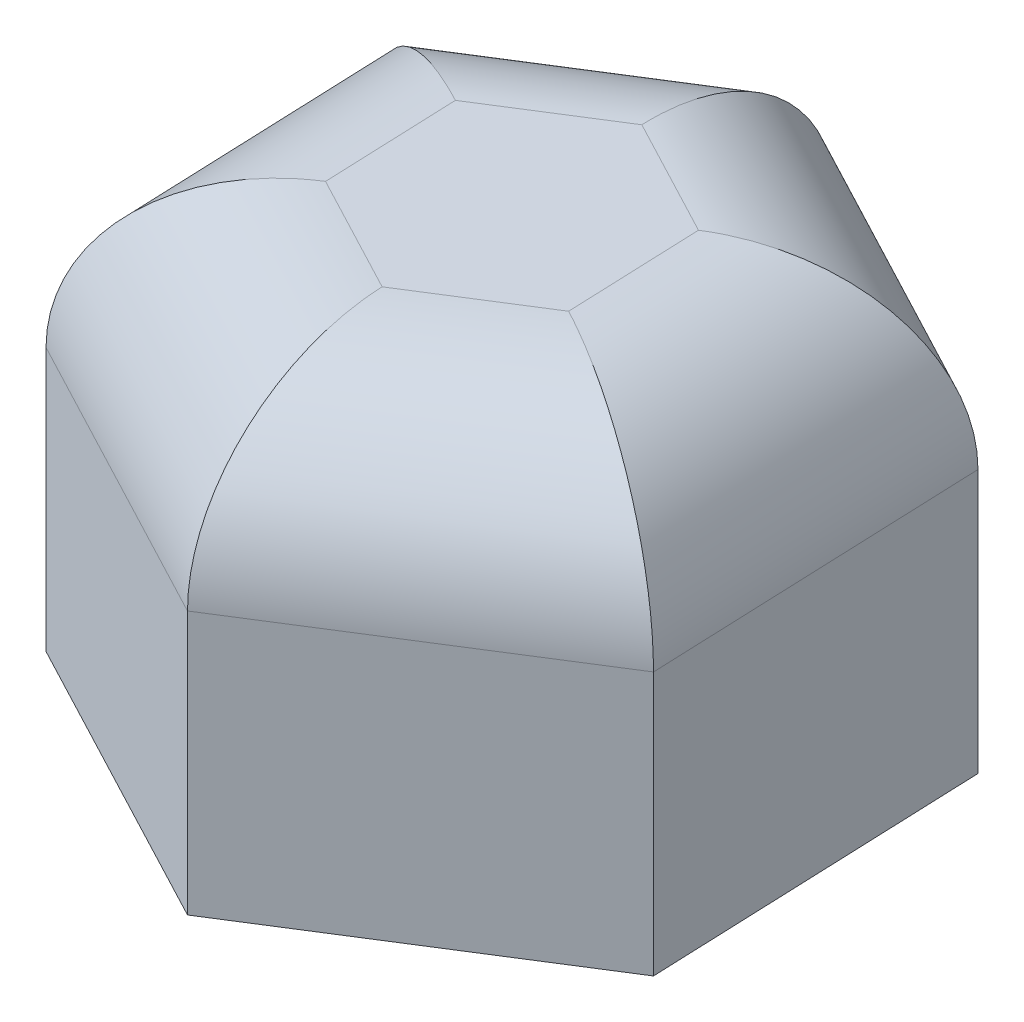
ISO-10303-21;
HEADER;
FILE_DESCRIPTION(('STEP AP214'),'2;1');
FILE_NAME('part.step','',(''),(''),'','','');
FILE_SCHEMA(('AUTOMOTIVE_DESIGN { 1 0 10303 214 1 1 1 1 }'));
ENDSEC;
DATA;
#1=APPLICATION_CONTEXT('core data for automotive mechanical design processes');
#2=APPLICATION_PROTOCOL_DEFINITION('international standard','automotive_design',2000,#1);
#3=PRODUCT_CONTEXT('',#1,'mechanical');
#4=PRODUCT('Part','Part','',(#3));
#5=PRODUCT_RELATED_PRODUCT_CATEGORY('part','',(#4));
#6=PRODUCT_DEFINITION_FORMATION('','',#4);
#7=PRODUCT_DEFINITION_CONTEXT('part definition',#1,'design');
#8=PRODUCT_DEFINITION('design','',#6,#7);
#9=PRODUCT_DEFINITION_SHAPE('','',#8);
#10=(LENGTH_UNIT() NAMED_UNIT(*) SI_UNIT(.MILLI.,.METRE.));
#11=(NAMED_UNIT(*) PLANE_ANGLE_UNIT() SI_UNIT($,.RADIAN.));
#12=(NAMED_UNIT(*) SI_UNIT($,.STERADIAN.) SOLID_ANGLE_UNIT());
#13=UNCERTAINTY_MEASURE_WITH_UNIT(LENGTH_MEASURE(1.E-05),#10,'distance_accuracy_value','');
#14=(GEOMETRIC_REPRESENTATION_CONTEXT(3) GLOBAL_UNCERTAINTY_ASSIGNED_CONTEXT((#13)) GLOBAL_UNIT_ASSIGNED_CONTEXT((#10,
#11,#12)) REPRESENTATION_CONTEXT('',''));
#15=CARTESIAN_POINT('',(0.,0.,0.));
#16=DIRECTION('',(0.,0.,1.));
#17=DIRECTION('',(1.,0.,0.));
#18=AXIS2_PLACEMENT_3D('',#15,#16,#17);
#19=CARTESIAN_POINT('',(-0.298844980738177,10.,-7.69419857278765));
#20=DIRECTION('',(0.533234627468384,0.,0.845967394211298));
#21=DIRECTION('',(0.845967394211298,0.,-0.533234627468384));
#22=AXIS2_PLACEMENT_3D('',#19,#20,#21);
#23=PLANE('',#22);
#24=DIRECTION('',(0.,-1.,0.));
#25=VECTOR('',#24,1.);
#26=CARTESIAN_POINT('',(-6.81279391616516,10.,-3.58829194128109));
#27=LINE('',#26,#25);
#28=CARTESIAN_POINT('',(-6.81279391616516,6.,-3.58829194128109));
#29=VERTEX_POINT('',#28);
#30=CARTESIAN_POINT('',(-6.81279391616516,0.,-3.58829194128109));
#31=VERTEX_POINT('',#30);
#32=EDGE_CURVE('E105',#29,#31,#27,.T.);
#33=ORIENTED_EDGE('',*,*,#32,.F.);
#34=DIRECTION('',(-0.845967394211298,0.,0.533234627468384));
#35=VECTOR('',#34,1.);
#36=CARTESIAN_POINT('',(-0.298844980738175,6.,-7.69419857278765));
#37=LINE('',#36,#35);
#38=CARTESIAN_POINT('',(-0.298844980738177,6.,-7.69419857278765));
#39=VERTEX_POINT('',#38);
#40=EDGE_CURVE('E11',#29,#39,#37,.F.);
#41=ORIENTED_EDGE('',*,*,#40,.T.);
#42=DIRECTION('',(0.,-1.,0.));
#43=VECTOR('',#42,1.);
#44=CARTESIAN_POINT('',(-0.298844980738177,10.,-7.69419857278765));
#45=LINE('',#44,#43);
#46=CARTESIAN_POINT('',(-0.298844980738177,0.,-7.69419857278765));
#47=VERTEX_POINT('',#46);
#48=EDGE_CURVE('E126',#39,#47,#45,.T.);
#49=ORIENTED_EDGE('',*,*,#48,.T.);
#50=DIRECTION('',(-0.845967394211298,0.,0.533234627468384));
#51=VECTOR('',#50,1.);
#52=CARTESIAN_POINT('',(-0.298844980738177,0.,-7.69419857278765));
#53=LINE('',#52,#51);
#54=EDGE_CURVE('E120',#47,#31,#53,.T.);
#55=ORIENTED_EDGE('',*,*,#54,.T.);
#56=EDGE_LOOP('',(#33,#41,#49,#55));
#57=FACE_BOUND('',#56,.T.);
#58=ADVANCED_FACE('F35',(#57),#23,.F.);
#59=CARTESIAN_POINT('',(-6.81279391616516,10.,-3.58829194128109));
#60=DIRECTION('',(0.999246567894501,0.,-0.0388110364595035));
#61=DIRECTION('',(-0.0388110364595035,0.,-0.999246567894501));
#62=AXIS2_PLACEMENT_3D('',#59,#60,#61);
#63=PLANE('',#62);
#64=DIRECTION('',(0.,-1.,0.));
#65=VECTOR('',#64,1.);
#66=CARTESIAN_POINT('',(-6.51394893542699,10.,4.10590663150655));
#67=LINE('',#66,#65);
#68=CARTESIAN_POINT('',(-6.51394893542699,6.,4.10590663150655));
#69=VERTEX_POINT('',#68);
#70=CARTESIAN_POINT('',(-6.51394893542699,0.,4.10590663150655));
#71=VERTEX_POINT('',#70);
#72=EDGE_CURVE('E114',#69,#71,#67,.T.);
#73=ORIENTED_EDGE('',*,*,#72,.F.);
#74=DIRECTION('',(0.0388110364595035,0.,0.999246567894501));
#75=VECTOR('',#74,1.);
#76=CARTESIAN_POINT('',(-6.81279391616516,6.,-3.58829194128109));
#77=LINE('',#76,#75);
#78=EDGE_CURVE('E44',#69,#29,#77,.F.);
#79=ORIENTED_EDGE('',*,*,#78,.T.);
#80=ORIENTED_EDGE('',*,*,#32,.T.);
#81=DIRECTION('',(0.0388110364595035,0.,0.999246567894501));
#82=VECTOR('',#81,1.);
#83=CARTESIAN_POINT('',(-6.81279391616516,0.,-3.58829194128109));
#84=LINE('',#83,#82);
#85=EDGE_CURVE('E108',#31,#71,#84,.T.);
#86=ORIENTED_EDGE('',*,*,#85,.T.);
#87=EDGE_LOOP('',(#73,#79,#80,#86));
#88=FACE_BOUND('',#87,.T.);
#89=ADVANCED_FACE('F107',(#88),#63,.F.);
#90=CARTESIAN_POINT('',(-6.51394893542699,10.,4.10590663150655));
#91=DIRECTION('',(0.466011940426117,0.,-0.884778430670801));
#92=DIRECTION('',(-0.884778430670801,0.,-0.466011940426117));
#93=AXIS2_PLACEMENT_3D('',#90,#91,#92);
#94=PLANE('',#93);
#95=DIRECTION('',(0.,-1.,0.));
#96=VECTOR('',#95,1.);
#97=CARTESIAN_POINT('',(0.298844980738173,10.,7.69419857278765));
#98=LINE('',#97,#96);
#99=CARTESIAN_POINT('',(0.298844980738173,6.,7.69419857278765));
#100=VERTEX_POINT('',#99);
#101=CARTESIAN_POINT('',(0.298844980738173,0.,7.69419857278765));
#102=VERTEX_POINT('',#101);
#103=EDGE_CURVE('E149',#100,#102,#98,.T.);
#104=ORIENTED_EDGE('',*,*,#103,.F.);
#105=DIRECTION('',(0.884778430670801,0.,0.466011940426117));
#106=VECTOR('',#105,1.);
#107=CARTESIAN_POINT('',(-6.51394893542698,6.,4.10590663150655));
#108=LINE('',#107,#106);
#109=EDGE_CURVE('E59',#100,#69,#108,.F.);
#110=ORIENTED_EDGE('',*,*,#109,.T.);
#111=ORIENTED_EDGE('',*,*,#72,.T.);
#112=DIRECTION('',(0.884778430670801,0.,0.466011940426117));
#113=VECTOR('',#112,1.);
#114=CARTESIAN_POINT('',(-6.51394893542699,0.,4.10590663150655));
#115=LINE('',#114,#113);
#116=EDGE_CURVE('E123',#71,#102,#115,.T.);
#117=ORIENTED_EDGE('',*,*,#116,.T.);
#118=EDGE_LOOP('',(#104,#110,#111,#117));
#119=FACE_BOUND('',#118,.T.);
#120=ADVANCED_FACE('F232',(#119),#94,.F.);
#121=CARTESIAN_POINT('',(0.298844980738173,10.,7.69419857278765));
#122=DIRECTION('',(-0.533234627468384,0.,-0.845967394211298));
#123=DIRECTION('',(-0.845967394211298,0.,0.533234627468384));
#124=AXIS2_PLACEMENT_3D('',#121,#122,#123);
#125=PLANE('',#124);
#126=DIRECTION('',(0.,-1.,0.));
#127=VECTOR('',#126,1.);
#128=CARTESIAN_POINT('',(6.81279391616516,10.,3.58829194128109));
#129=LINE('',#128,#127);
#130=CARTESIAN_POINT('',(6.81279391616516,6.,3.58829194128109));
#131=VERTEX_POINT('',#130);
#132=CARTESIAN_POINT('',(6.81279391616516,0.,3.58829194128109));
#133=VERTEX_POINT('',#132);
#134=EDGE_CURVE('E147',#131,#133,#129,.T.);
#135=ORIENTED_EDGE('',*,*,#134,.F.);
#136=DIRECTION('',(0.845967394211298,0.,-0.533234627468384));
#137=VECTOR('',#136,1.);
#138=CARTESIAN_POINT('',(0.298844980738173,6.,7.69419857278765));
#139=LINE('',#138,#137);
#140=EDGE_CURVE('E169',#131,#100,#139,.F.);
#141=ORIENTED_EDGE('',*,*,#140,.T.);
#142=ORIENTED_EDGE('',*,*,#103,.T.);
#143=DIRECTION('',(0.845967394211298,0.,-0.533234627468384));
#144=VECTOR('',#143,1.);
#145=CARTESIAN_POINT('',(0.298844980738173,0.,7.69419857278765));
#146=LINE('',#145,#144);
#147=EDGE_CURVE('E136',#102,#133,#146,.T.);
#148=ORIENTED_EDGE('',*,*,#147,.T.);
#149=EDGE_LOOP('',(#135,#141,#142,#148));
#150=FACE_BOUND('',#149,.T.);
#151=ADVANCED_FACE('F217',(#150),#125,.F.);
#152=CARTESIAN_POINT('',(6.81279391616516,10.,3.58829194128109));
#153=DIRECTION('',(-0.999246567894501,0.,0.0388110364595033));
#154=DIRECTION('',(0.0388110364595033,0.,0.999246567894501));
#155=AXIS2_PLACEMENT_3D('',#152,#153,#154);
#156=PLANE('',#155);
#157=DIRECTION('',(0.,-1.,0.));
#158=VECTOR('',#157,1.);
#159=CARTESIAN_POINT('',(6.51394893542698,10.,-4.10590663150656));
#160=LINE('',#159,#158);
#161=CARTESIAN_POINT('',(6.51394893542698,6.,-4.10590663150656));
#162=VERTEX_POINT('',#161);
#163=CARTESIAN_POINT('',(6.51394893542698,0.,-4.10590663150656));
#164=VERTEX_POINT('',#163);
#165=EDGE_CURVE('E145',#162,#164,#160,.T.);
#166=ORIENTED_EDGE('',*,*,#165,.F.);
#167=DIRECTION('',(-0.0388110364595033,0.,-0.999246567894501));
#168=VECTOR('',#167,1.);
#169=CARTESIAN_POINT('',(6.81279391616516,6.,3.58829194128109));
#170=LINE('',#169,#168);
#171=EDGE_CURVE('E167',#162,#131,#170,.F.);
#172=ORIENTED_EDGE('',*,*,#171,.T.);
#173=ORIENTED_EDGE('',*,*,#134,.T.);
#174=DIRECTION('',(-0.0388110364595033,0.,-0.999246567894501));
#175=VECTOR('',#174,1.);
#176=CARTESIAN_POINT('',(6.81279391616516,0.,3.58829194128109));
#177=LINE('',#176,#175);
#178=EDGE_CURVE('E139',#133,#164,#177,.T.);
#179=ORIENTED_EDGE('',*,*,#178,.T.);
#180=EDGE_LOOP('',(#166,#172,#173,#179));
#181=FACE_BOUND('',#180,.T.);
#182=ADVANCED_FACE('F214',(#181),#156,.F.);
#183=CARTESIAN_POINT('',(6.51394893542698,10.,-4.10590663150656));
#184=DIRECTION('',(-0.466011940426117,0.,0.884778430670801));
#185=DIRECTION('',(0.884778430670801,0.,0.466011940426117));
#186=AXIS2_PLACEMENT_3D('',#183,#184,#185);
#187=PLANE('',#186);
#188=ORIENTED_EDGE('',*,*,#48,.F.);
#189=DIRECTION('',(-0.884778430670801,0.,-0.466011940426117));
#190=VECTOR('',#189,1.);
#191=CARTESIAN_POINT('',(6.51394893542698,6.,-4.10590663150656));
#192=LINE('',#191,#190);
#193=EDGE_CURVE('E164',#39,#162,#192,.F.);
#194=ORIENTED_EDGE('',*,*,#193,.T.);
#195=ORIENTED_EDGE('',*,*,#165,.T.);
#196=DIRECTION('',(-0.884778430670801,0.,-0.466011940426116));
#197=VECTOR('',#196,1.);
#198=CARTESIAN_POINT('',(6.51394893542698,0.,-4.10590663150656));
#199=LINE('',#198,#197);
#200=EDGE_CURVE('E142',#164,#47,#199,.T.);
#201=ORIENTED_EDGE('',*,*,#200,.T.);
#202=EDGE_LOOP('',(#188,#194,#195,#201));
#203=FACE_BOUND('',#202,.T.);
#204=ADVANCED_FACE('F203',(#203),#187,.F.);
#205=CARTESIAN_POINT('',(0.,10.,0.));
#206=DIRECTION('',(0.,1.,0.));
#207=DIRECTION('',(0.,0.,1.));
#208=AXIS2_PLACEMENT_3D('',#205,#206,#207);
#209=PLANE('',#208);
#210=DIRECTION('',(-0.0388110364595033,0.,-0.999246567894501));
#211=VECTOR('',#210,1.);
#212=CARTESIAN_POINT('',(2.51696266384898,10.,-3.95066248566854));
#213=LINE('',#212,#211);
#214=CARTESIAN_POINT('',(2.72617739519747,10.,1.43587498727631));
#215=VERTEX_POINT('',#214);
#216=CARTESIAN_POINT('',(2.60659291323867,10.,-1.64300138582574));
#217=VERTEX_POINT('',#216);
#218=EDGE_CURVE('E159',#215,#217,#213,.T.);
#219=ORIENTED_EDGE('',*,*,#218,.T.);
#220=DIRECTION('',(-0.884778430670801,0.,-0.466011940426117));
#221=VECTOR('',#220,1.);
#222=CARTESIAN_POINT('',(-2.16289274244264,10.,-4.15508485010444));
#223=LINE('',#222,#221);
#224=CARTESIAN_POINT('',(-0.119584481958795,10.,-3.07887637310205));
#225=VERTEX_POINT('',#224);
#226=EDGE_CURVE('E161',#217,#225,#223,.T.);
#227=ORIENTED_EDGE('',*,*,#226,.T.);
#228=DIRECTION('',(-0.845967394211298,0.,0.533234627468384));
#229=VECTOR('',#228,1.);
#230=CARTESIAN_POINT('',(-4.67985540629162,10.,-0.204422364435901));
#231=LINE('',#230,#229);
#232=CARTESIAN_POINT('',(-2.72617739519747,10.,-1.43587498727631));
#233=VERTEX_POINT('',#232);
#234=EDGE_CURVE('E113',#225,#233,#231,.T.);
#235=ORIENTED_EDGE('',*,*,#234,.T.);
#236=DIRECTION('',(0.0388110364595035,0.,0.999246567894501));
#237=VECTOR('',#236,1.);
#238=CARTESIAN_POINT('',(-2.51696266384898,10.,3.95066248566854));
#239=LINE('',#238,#237);
#240=CARTESIAN_POINT('',(-2.60659291323867,10.,1.64300138582574));
#241=VERTEX_POINT('',#240);
#242=EDGE_CURVE('E153',#233,#241,#239,.T.);
#243=ORIENTED_EDGE('',*,*,#242,.T.);
#244=DIRECTION('',(0.884778430670801,0.,0.466011940426117));
#245=VECTOR('',#244,1.);
#246=CARTESIAN_POINT('',(2.16289274244264,10.,4.15508485010444));
#247=LINE('',#246,#245);
#248=CARTESIAN_POINT('',(0.119584481958793,10.,3.07887637310205));
#249=VERTEX_POINT('',#248);
#250=EDGE_CURVE('E155',#241,#249,#247,.T.);
#251=ORIENTED_EDGE('',*,*,#250,.T.);
#252=DIRECTION('',(0.845967394211298,0.,-0.533234627468384));
#253=VECTOR('',#252,1.);
#254=CARTESIAN_POINT('',(4.67985540629162,10.,0.2044223644359));
#255=LINE('',#254,#253);
#256=EDGE_CURVE('E157',#249,#215,#255,.T.);
#257=ORIENTED_EDGE('',*,*,#256,.T.);
#258=EDGE_LOOP('',(#219,#227,#235,#243,#251,#257));
#259=FACE_BOUND('',#258,.T.);
#260=ADVANCED_FACE('F193',(#259),#209,.T.);
#261=CARTESIAN_POINT('',(0.,0.,0.));
#262=DIRECTION('',(0.,1.,0.));
#263=DIRECTION('',(0.,0.,1.));
#264=AXIS2_PLACEMENT_3D('',#261,#262,#263);
#265=PLANE('',#264);
#266=CARTESIAN_POINT('',(0.,0.,0.));
#267=DIRECTION('',(0.,-1.,0.));
#268=DIRECTION('',(0.,0.,-1.));
#269=AXIS2_PLACEMENT_3D('',#266,#267,#268);
#270=CIRCLE('',#269,4.1);
#271=CARTESIAN_POINT('',(0.,0.,-4.1));
#272=VERTEX_POINT('',#271);
#273=EDGE_CURVE('E132',#272,#272,#270,.T.);
#274=ORIENTED_EDGE('',*,*,#273,.F.);
#275=EDGE_LOOP('',(#274));
#276=FACE_BOUND('',#275,.T.);
#277=ORIENTED_EDGE('',*,*,#54,.F.);
#278=ORIENTED_EDGE('',*,*,#200,.F.);
#279=ORIENTED_EDGE('',*,*,#178,.F.);
#280=ORIENTED_EDGE('',*,*,#147,.F.);
#281=ORIENTED_EDGE('',*,*,#116,.F.);
#282=ORIENTED_EDGE('',*,*,#85,.F.);
#283=EDGE_LOOP('',(#277,#278,#279,#280,#281,#282));
#284=FACE_BOUND('',#283,.T.);
#285=ADVANCED_FACE('F118',(#276,#284),#265,.F.);
#286=CARTESIAN_POINT('',(-1.24350421563994,6.,2.3609388794639));
#287=DIRECTION('',(-0.884778430670801,0.,-0.466011940426117));
#288=DIRECTION('',(-0.466011940426117,0.,0.884778430670801));
#289=AXIS2_PLACEMENT_3D('',#286,#287,#288);
#290=CYLINDRICAL_SURFACE('',#289,4.);
#291=CARTESIAN_POINT('',(-2.60659291323867,6.,1.64300138582574));
#292=DIRECTION('',(-0.533234627468384,0.,-0.845967394211298));
#293=DIRECTION('',(0.845967394211298,0.,-0.533234627468384));
#294=AXIS2_PLACEMENT_3D('',#291,#292,#293);
#295=ELLIPSE('',#294,4.61880215351701,4.);
#296=EDGE_CURVE('E130',#69,#241,#295,.T.);
#297=ORIENTED_EDGE('',*,*,#296,.F.);
#298=ORIENTED_EDGE('',*,*,#109,.F.);
#299=CARTESIAN_POINT('',(0.119584481958792,6.,3.07887637310205));
#300=DIRECTION('',(-0.999246567894501,0.,0.0388110364595033));
#301=DIRECTION('',(-0.0388110364595032,0.,-0.999246567894501));
#302=AXIS2_PLACEMENT_3D('',#299,#300,#301);
#303=ELLIPSE('',#302,4.61880215351701,4.);
#304=EDGE_CURVE('E39',#249,#100,#303,.F.);
#305=ORIENTED_EDGE('',*,*,#304,.F.);
#306=ORIENTED_EDGE('',*,*,#250,.F.);
#307=EDGE_LOOP('',(#297,#298,#305,#306));
#308=FACE_BOUND('',#307,.T.);
#309=ADVANCED_FACE('F37',(#308),#290,.T.);
#310=CARTESIAN_POINT('',(1.42288093857813,6.,2.25737568018918));
#311=DIRECTION('',(-0.845967394211298,0.,0.533234627468384));
#312=DIRECTION('',(0.533234627468384,0.,0.845967394211298));
#313=AXIS2_PLACEMENT_3D('',#310,#311,#312);
#314=CYLINDRICAL_SURFACE('',#313,4.);
#315=ORIENTED_EDGE('',*,*,#304,.T.);
#316=ORIENTED_EDGE('',*,*,#140,.F.);
#317=CARTESIAN_POINT('',(2.72617739519747,6.,1.43587498727631));
#318=DIRECTION('',(-0.466011940426116,0.,0.884778430670801));
#319=DIRECTION('',(-0.884778430670801,0.,-0.466011940426116));
#320=AXIS2_PLACEMENT_3D('',#317,#318,#319);
#321=ELLIPSE('',#320,4.61880215351701,4.);
#322=EDGE_CURVE('E181',#215,#131,#321,.F.);
#323=ORIENTED_EDGE('',*,*,#322,.F.);
#324=ORIENTED_EDGE('',*,*,#256,.F.);
#325=EDGE_LOOP('',(#315,#316,#323,#324));
#326=FACE_BOUND('',#325,.T.);
#327=ADVANCED_FACE('F220',(#326),#314,.T.);
#328=CARTESIAN_POINT('',(-2.66638515421807,6.,0.103563199274718));
#329=DIRECTION('',(-0.0388110364595035,0.,-0.999246567894501));
#330=DIRECTION('',(-0.999246567894501,0.,0.0388110364595035));
#331=AXIS2_PLACEMENT_3D('',#328,#329,#330);
#332=CYLINDRICAL_SURFACE('',#331,4.);
#333=ORIENTED_EDGE('',*,*,#296,.T.);
#334=ORIENTED_EDGE('',*,*,#242,.F.);
#335=CARTESIAN_POINT('',(-2.72617739519747,6.,-1.43587498727631));
#336=DIRECTION('',(0.466011940426116,0.,-0.884778430670801));
#337=DIRECTION('',(0.884778430670801,0.,0.466011940426116));
#338=AXIS2_PLACEMENT_3D('',#335,#336,#337);
#339=ELLIPSE('',#338,4.61880215351701,4.);
#340=EDGE_CURVE('E178',#29,#233,#339,.T.);
#341=ORIENTED_EDGE('',*,*,#340,.F.);
#342=ORIENTED_EDGE('',*,*,#78,.F.);
#343=EDGE_LOOP('',(#333,#334,#341,#342));
#344=FACE_BOUND('',#343,.T.);
#345=ADVANCED_FACE('F187',(#344),#332,.T.);
#346=CARTESIAN_POINT('',(2.66638515421807,6.,-0.103563199274718));
#347=DIRECTION('',(0.0388110364595033,0.,0.999246567894501));
#348=DIRECTION('',(0.999246567894501,0.,-0.0388110364595033));
#349=AXIS2_PLACEMENT_3D('',#346,#347,#348);
#350=CYLINDRICAL_SURFACE('',#349,4.);
#351=ORIENTED_EDGE('',*,*,#322,.T.);
#352=ORIENTED_EDGE('',*,*,#171,.F.);
#353=CARTESIAN_POINT('',(2.60659291323867,6.,-1.64300138582574));
#354=DIRECTION('',(0.533234627468384,0.,0.845967394211298));
#355=DIRECTION('',(-0.845967394211298,0.,0.533234627468384));
#356=AXIS2_PLACEMENT_3D('',#353,#354,#355);
#357=ELLIPSE('',#356,4.61880215351701,4.);
#358=EDGE_CURVE('E175',#217,#162,#357,.F.);
#359=ORIENTED_EDGE('',*,*,#358,.F.);
#360=ORIENTED_EDGE('',*,*,#218,.F.);
#361=EDGE_LOOP('',(#351,#352,#359,#360));
#362=FACE_BOUND('',#361,.T.);
#363=ADVANCED_FACE('F211',(#362),#350,.T.);
#364=CARTESIAN_POINT('',(-1.42288093857813,6.,-2.25737568018918));
#365=DIRECTION('',(0.845967394211298,0.,-0.533234627468384));
#366=DIRECTION('',(-0.533234627468384,0.,-0.845967394211298));
#367=AXIS2_PLACEMENT_3D('',#364,#365,#366);
#368=CYLINDRICAL_SURFACE('',#367,4.);
#369=ORIENTED_EDGE('',*,*,#340,.T.);
#370=ORIENTED_EDGE('',*,*,#234,.F.);
#371=CARTESIAN_POINT('',(-0.119584481958795,6.,-3.07887637310205));
#372=DIRECTION('',(0.999246567894501,0.,-0.0388110364595034));
#373=DIRECTION('',(-0.0388110364595033,0.,-0.999246567894501));
#374=AXIS2_PLACEMENT_3D('',#371,#372,#373);
#375=ELLIPSE('',#374,4.61880215351701,4.);
#376=EDGE_CURVE('E173',#39,#225,#375,.T.);
#377=ORIENTED_EDGE('',*,*,#376,.F.);
#378=ORIENTED_EDGE('',*,*,#40,.F.);
#379=EDGE_LOOP('',(#369,#370,#377,#378));
#380=FACE_BOUND('',#379,.T.);
#381=ADVANCED_FACE('F199',(#380),#368,.T.);
#382=CARTESIAN_POINT('',(1.24350421563994,6.,-2.3609388794639));
#383=DIRECTION('',(0.884778430670801,0.,0.466011940426117));
#384=DIRECTION('',(0.466011940426117,0.,-0.884778430670801));
#385=AXIS2_PLACEMENT_3D('',#382,#383,#384);
#386=CYLINDRICAL_SURFACE('',#385,4.);
#387=ORIENTED_EDGE('',*,*,#358,.T.);
#388=ORIENTED_EDGE('',*,*,#193,.F.);
#389=ORIENTED_EDGE('',*,*,#376,.T.);
#390=ORIENTED_EDGE('',*,*,#226,.F.);
#391=EDGE_LOOP('',(#387,#388,#389,#390));
#392=FACE_BOUND('',#391,.T.);
#393=ADVANCED_FACE('F206',(#392),#386,.T.);
#394=CARTESIAN_POINT('',(0.,8.,0.));
#395=DIRECTION('',(0.,-1.,0.));
#396=DIRECTION('',(0.,0.,-1.));
#397=AXIS2_PLACEMENT_3D('',#394,#395,#396);
#398=CYLINDRICAL_SURFACE('',#397,4.1);
#399=CARTESIAN_POINT('',(0.,8.,0.));
#400=DIRECTION('',(0.,-1.,0.));
#401=DIRECTION('',(0.,0.,-1.));
#402=AXIS2_PLACEMENT_3D('',#399,#400,#401);
#403=CIRCLE('',#402,4.1);
#404=CARTESIAN_POINT('',(0.,8.,-4.1));
#405=VERTEX_POINT('',#404);
#406=EDGE_CURVE('E176',#405,#405,#403,.T.);
#407=ORIENTED_EDGE('',*,*,#406,.F.);
#408=EDGE_LOOP('',(#407));
#409=FACE_BOUND('',#408,.T.);
#410=ORIENTED_EDGE('',*,*,#273,.T.);
#411=EDGE_LOOP('',(#410));
#412=FACE_BOUND('',#411,.T.);
#413=ADVANCED_FACE('F238',(#409,#412),#398,.F.);
#414=CARTESIAN_POINT('',(0.,8.,0.));
#415=DIRECTION('',(0.,-1.,0.));
#416=DIRECTION('',(0.,0.,-1.));
#417=AXIS2_PLACEMENT_3D('',#414,#415,#416);
#418=PLANE('',#417);
#419=ORIENTED_EDGE('',*,*,#406,.T.);
#420=EDGE_LOOP('',(#419));
#421=FACE_BOUND('',#420,.T.);
#422=ADVANCED_FACE('F261',(#421),#418,.T.);
#423=CLOSED_SHELL('',(#58,#89,#120,#151,#182,#204,#260,#285,#309,#327,#345,#363,#381,#393,#413,#422));
#424=MANIFOLD_SOLID_BREP('B2',#423);
#425=ADVANCED_BREP_SHAPE_REPRESENTATION('',(#18,#424),#14);
#426=SHAPE_DEFINITION_REPRESENTATION(#9,#425);
ENDSEC;
END-ISO-10303-21;
